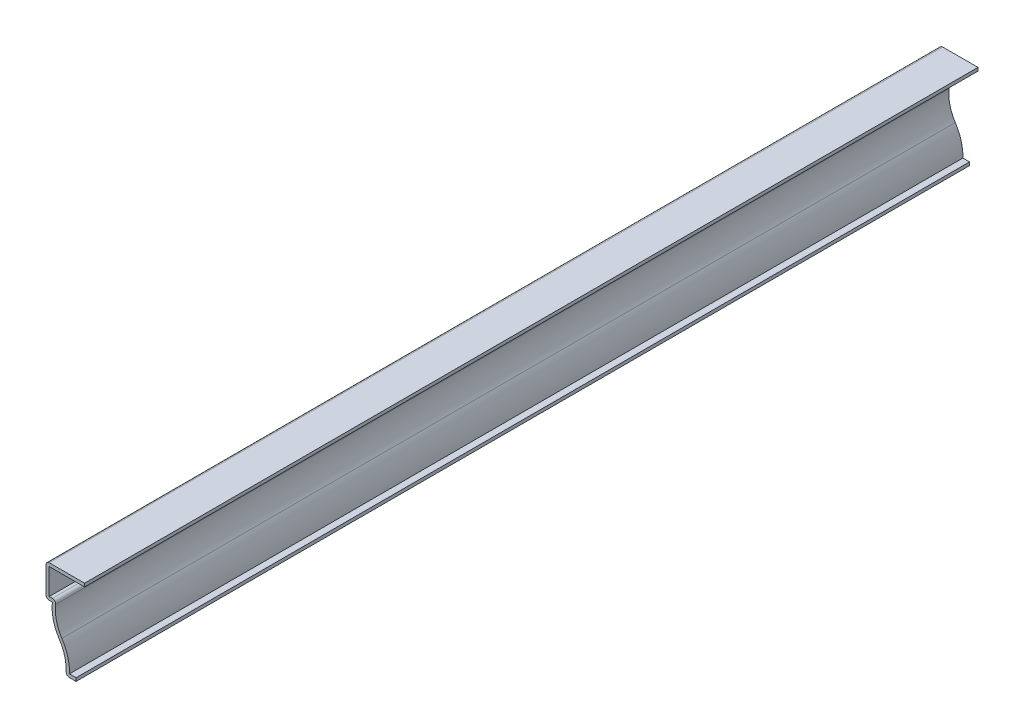
ISO-10303-21;
HEADER;
FILE_DESCRIPTION(('STEP AP214'),'2;1');
FILE_NAME('part.step','',(''),(''),'','','');
FILE_SCHEMA(('AUTOMOTIVE_DESIGN { 1 0 10303 214 1 1 1 1 }'));
ENDSEC;
DATA;
#1=APPLICATION_CONTEXT('core data for automotive mechanical design processes');
#2=APPLICATION_PROTOCOL_DEFINITION('international standard','automotive_design',2000,#1);
#3=PRODUCT_CONTEXT('',#1,'mechanical');
#4=PRODUCT('Part','Part','',(#3));
#5=PRODUCT_RELATED_PRODUCT_CATEGORY('part','',(#4));
#6=PRODUCT_DEFINITION_FORMATION('','',#4);
#7=PRODUCT_DEFINITION_CONTEXT('part definition',#1,'design');
#8=PRODUCT_DEFINITION('design','',#6,#7);
#9=PRODUCT_DEFINITION_SHAPE('','',#8);
#10=(LENGTH_UNIT() NAMED_UNIT(*) SI_UNIT(.MILLI.,.METRE.));
#11=(NAMED_UNIT(*) PLANE_ANGLE_UNIT() SI_UNIT($,.RADIAN.));
#12=(NAMED_UNIT(*) SI_UNIT($,.STERADIAN.) SOLID_ANGLE_UNIT());
#13=UNCERTAINTY_MEASURE_WITH_UNIT(LENGTH_MEASURE(1.E-05),#10,'distance_accuracy_value','');
#14=(GEOMETRIC_REPRESENTATION_CONTEXT(3) GLOBAL_UNCERTAINTY_ASSIGNED_CONTEXT((#13)) GLOBAL_UNIT_ASSIGNED_CONTEXT((#10,
#11,#12)) REPRESENTATION_CONTEXT('',''));
#15=CARTESIAN_POINT('',(0.,0.,0.));
#16=DIRECTION('',(0.,0.,1.));
#17=DIRECTION('',(1.,0.,0.));
#18=AXIS2_PLACEMENT_3D('',#15,#16,#17);
#19=CARTESIAN_POINT('',(-7.28179347826087,0.,-349.25));
#20=DIRECTION('',(0.,-1.,0.));
#21=DIRECTION('',(0.,0.,-1.));
#22=AXIS2_PLACEMENT_3D('',#19,#20,#21);
#23=PLANE('',#22);
#24=DIRECTION('',(1.,0.,0.));
#25=VECTOR('',#24,1.);
#26=CARTESIAN_POINT('',(-7.28179347826087,0.,0.));
#27=LINE('',#26,#25);
#28=CARTESIAN_POINT('',(-5.91270240569899,0.,0.));
#29=VERTEX_POINT('',#28);
#30=CARTESIAN_POINT('',(-3.31304347826087,0.,0.));
#31=VERTEX_POINT('',#30);
#32=EDGE_CURVE('E286',#29,#31,#27,.T.);
#33=ORIENTED_EDGE('',*,*,#32,.F.);
#34=DIRECTION('',(0.,0.,1.));
#35=VECTOR('',#34,1.);
#36=CARTESIAN_POINT('',(-5.91270240569899,0.,-349.25));
#37=LINE('',#36,#35);
#38=CARTESIAN_POINT('',(-5.91270240569899,0.,-349.25));
#39=VERTEX_POINT('',#38);
#40=EDGE_CURVE('E168',#29,#39,#37,.F.);
#41=ORIENTED_EDGE('',*,*,#40,.T.);
#42=DIRECTION('',(1.,0.,0.));
#43=VECTOR('',#42,1.);
#44=CARTESIAN_POINT('',(-7.28179347826087,0.,-349.25));
#45=LINE('',#44,#43);
#46=CARTESIAN_POINT('',(-3.31304347826087,0.,-349.25));
#47=VERTEX_POINT('',#46);
#48=EDGE_CURVE('E161',#39,#47,#45,.T.);
#49=ORIENTED_EDGE('',*,*,#48,.T.);
#50=DIRECTION('',(0.,0.,1.));
#51=VECTOR('',#50,1.);
#52=CARTESIAN_POINT('',(-3.31304347826087,0.,-349.25));
#53=LINE('',#52,#51);
#54=EDGE_CURVE('E165',#47,#31,#53,.T.);
#55=ORIENTED_EDGE('',*,*,#54,.T.);
#56=EDGE_LOOP('',(#33,#41,#49,#55));
#57=FACE_BOUND('',#56,.T.);
#58=ADVANCED_FACE('F35',(#57),#23,.T.);
#59=CARTESIAN_POINT('',(-23.839707036905,1.91904276840574,-349.25));
#60=DIRECTION('',(0.,0.,1.));
#61=DIRECTION('',(1.,0.,0.));
#62=AXIS2_PLACEMENT_3D('',#59,#60,#61);
#63=CYLINDRICAL_SURFACE('',#62,16.66875);
#64=CARTESIAN_POINT('',(-23.839707036905,1.91904276840574,-349.25));
#65=DIRECTION('',(0.,0.,-1.));
#66=DIRECTION('',(-1.,0.,0.));
#67=AXIS2_PLACEMENT_3D('',#64,#65,#66);
#68=CIRCLE('',#67,16.66875);
#69=CARTESIAN_POINT('',(-9.93547851845248,11.1125,-349.25));
#70=VERTEX_POINT('',#69);
#71=CARTESIAN_POINT('',(-7.1818708751649,1.3159499305066,-349.25));
#72=VERTEX_POINT('',#71);
#73=EDGE_CURVE('E185',#70,#72,#68,.T.);
#74=ORIENTED_EDGE('',*,*,#73,.T.);
#75=DIRECTION('',(0.,0.,1.));
#76=VECTOR('',#75,1.);
#77=CARTESIAN_POINT('',(-7.18187087516489,1.3159499305066,-349.25));
#78=LINE('',#77,#76);
#79=CARTESIAN_POINT('',(-7.1818708751649,1.3159499305066,0.));
#80=VERTEX_POINT('',#79);
#81=EDGE_CURVE('E194',#72,#80,#78,.T.);
#82=ORIENTED_EDGE('',*,*,#81,.T.);
#83=CARTESIAN_POINT('',(-23.839707036905,1.91904276840574,0.));
#84=DIRECTION('',(0.,0.,-1.));
#85=DIRECTION('',(-1.,0.,0.));
#86=AXIS2_PLACEMENT_3D('',#83,#84,#85);
#87=CIRCLE('',#86,16.66875);
#88=CARTESIAN_POINT('',(-9.93547851845248,11.1125,0.));
#89=VERTEX_POINT('',#88);
#90=EDGE_CURVE('E171',#89,#80,#87,.T.);
#91=ORIENTED_EDGE('',*,*,#90,.F.);
#92=DIRECTION('',(0.,0.,1.));
#93=VECTOR('',#92,1.);
#94=CARTESIAN_POINT('',(-9.93547851845248,11.1125,-349.25));
#95=LINE('',#94,#93);
#96=EDGE_CURVE('E198',#70,#89,#95,.T.);
#97=ORIENTED_EDGE('',*,*,#96,.F.);
#98=EDGE_LOOP('',(#74,#82,#91,#97));
#99=FACE_BOUND('',#98,.T.);
#100=ADVANCED_FACE('F322',(#99),#63,.F.);
#101=CARTESIAN_POINT('',(3.96875,20.3059572315943,-349.25));
#102=DIRECTION('',(0.,0.,1.));
#103=DIRECTION('',(1.,0.,0.));
#104=AXIS2_PLACEMENT_3D('',#101,#102,#103);
#105=CYLINDRICAL_SURFACE('',#104,16.66875);
#106=CARTESIAN_POINT('',(3.96875,20.3059572315943,0.));
#107=DIRECTION('',(0.,0.,1.));
#108=DIRECTION('',(1.,0.,0.));
#109=AXIS2_PLACEMENT_3D('',#106,#107,#108);
#110=CIRCLE('',#109,16.66875);
#111=CARTESIAN_POINT('',(-12.5891635586441,22.225,0.));
#112=VERTEX_POINT('',#111);
#113=EDGE_CURVE('E260',#112,#89,#110,.T.);
#114=ORIENTED_EDGE('',*,*,#113,.F.);
#115=DIRECTION('',(0.,0.,1.));
#116=VECTOR('',#115,1.);
#117=CARTESIAN_POINT('',(-12.5891635586441,22.225,-349.25));
#118=LINE('',#117,#116);
#119=CARTESIAN_POINT('',(-12.5891635586441,22.225,-349.25));
#120=VERTEX_POINT('',#119);
#121=EDGE_CURVE('E265',#120,#112,#118,.T.);
#122=ORIENTED_EDGE('',*,*,#121,.F.);
#123=CARTESIAN_POINT('',(3.96875,20.3059572315943,-349.25));
#124=DIRECTION('',(0.,0.,1.));
#125=DIRECTION('',(1.,0.,0.));
#126=AXIS2_PLACEMENT_3D('',#123,#124,#125);
#127=CIRCLE('',#126,16.66875);
#128=EDGE_CURVE('E190',#120,#70,#127,.T.);
#129=ORIENTED_EDGE('',*,*,#128,.T.);
#130=ORIENTED_EDGE('',*,*,#96,.T.);
#131=EDGE_LOOP('',(#114,#122,#129,#130));
#132=FACE_BOUND('',#131,.T.);
#133=ADVANCED_FACE('F327',(#132),#105,.T.);
#134=CARTESIAN_POINT('',(-15.08125,22.225,-349.25));
#135=DIRECTION('',(0.,-1.,0.));
#136=DIRECTION('',(0.,0.,-1.));
#137=AXIS2_PLACEMENT_3D('',#134,#135,#136);
#138=PLANE('',#137);
#139=DIRECTION('',(1.,0.,0.));
#140=VECTOR('',#139,1.);
#141=CARTESIAN_POINT('',(-15.08125,22.225,0.));
#142=LINE('',#141,#140);
#143=CARTESIAN_POINT('',(-13.81125,22.225,0.));
#144=VERTEX_POINT('',#143);
#145=EDGE_CURVE('E258',#144,#112,#142,.T.);
#146=ORIENTED_EDGE('',*,*,#145,.F.);
#147=DIRECTION('',(0.,0.,1.));
#148=VECTOR('',#147,1.);
#149=CARTESIAN_POINT('',(-13.81125,22.225,-349.25));
#150=LINE('',#149,#148);
#151=CARTESIAN_POINT('',(-13.81125,22.225,-349.25));
#152=VERTEX_POINT('',#151);
#153=EDGE_CURVE('E219',#144,#152,#150,.F.);
#154=ORIENTED_EDGE('',*,*,#153,.T.);
#155=DIRECTION('',(1.,0.,0.));
#156=VECTOR('',#155,1.);
#157=CARTESIAN_POINT('',(-15.08125,22.225,-349.25));
#158=LINE('',#157,#156);
#159=EDGE_CURVE('E292',#152,#120,#158,.T.);
#160=ORIENTED_EDGE('',*,*,#159,.T.);
#161=ORIENTED_EDGE('',*,*,#121,.T.);
#162=EDGE_LOOP('',(#146,#154,#160,#161));
#163=FACE_BOUND('',#162,.T.);
#164=ADVANCED_FACE('F386',(#163),#138,.T.);
#165=CARTESIAN_POINT('',(-15.08125,34.925,-349.25));
#166=DIRECTION('',(-1.,0.,0.));
#167=DIRECTION('',(0.,-1.,0.));
#168=AXIS2_PLACEMENT_3D('',#165,#166,#167);
#169=PLANE('',#168);
#170=DIRECTION('',(0.,-1.,0.));
#171=VECTOR('',#170,1.);
#172=CARTESIAN_POINT('',(-15.08125,34.925,-349.25));
#173=LINE('',#172,#171);
#174=CARTESIAN_POINT('',(-15.08125,33.655,-349.25));
#175=VERTEX_POINT('',#174);
#176=CARTESIAN_POINT('',(-15.08125,23.495,-349.25));
#177=VERTEX_POINT('',#176);
#178=EDGE_CURVE('E294',#175,#177,#173,.T.);
#179=ORIENTED_EDGE('',*,*,#178,.T.);
#180=DIRECTION('',(0.,0.,1.));
#181=VECTOR('',#180,1.);
#182=CARTESIAN_POINT('',(-15.08125,23.495,-349.25));
#183=LINE('',#182,#181);
#184=CARTESIAN_POINT('',(-15.08125,23.495,0.));
#185=VERTEX_POINT('',#184);
#186=EDGE_CURVE('E216',#177,#185,#183,.T.);
#187=ORIENTED_EDGE('',*,*,#186,.T.);
#188=DIRECTION('',(0.,-1.,0.));
#189=VECTOR('',#188,1.);
#190=CARTESIAN_POINT('',(-15.08125,34.925,0.));
#191=LINE('',#190,#189);
#192=CARTESIAN_POINT('',(-15.08125,33.655,0.));
#193=VERTEX_POINT('',#192);
#194=EDGE_CURVE('E255',#193,#185,#191,.T.);
#195=ORIENTED_EDGE('',*,*,#194,.F.);
#196=DIRECTION('',(0.,0.,1.));
#197=VECTOR('',#196,1.);
#198=CARTESIAN_POINT('',(-15.08125,33.655,-349.25));
#199=LINE('',#198,#197);
#200=EDGE_CURVE('E214',#193,#175,#199,.F.);
#201=ORIENTED_EDGE('',*,*,#200,.T.);
#202=EDGE_LOOP('',(#179,#187,#195,#201));
#203=FACE_BOUND('',#202,.T.);
#204=ADVANCED_FACE('F383',(#203),#169,.T.);
#205=CARTESIAN_POINT('',(0.,34.925,-349.25));
#206=DIRECTION('',(0.,1.,0.));
#207=DIRECTION('',(0.,0.,1.));
#208=AXIS2_PLACEMENT_3D('',#205,#206,#207);
#209=PLANE('',#208);
#210=DIRECTION('',(-1.,0.,0.));
#211=VECTOR('',#210,1.);
#212=CARTESIAN_POINT('',(0.,34.925,-349.25));
#213=LINE('',#212,#211);
#214=CARTESIAN_POINT('',(0.,34.925,-349.25));
#215=VERTEX_POINT('',#214);
#216=CARTESIAN_POINT('',(-13.81125,34.925,-349.25));
#217=VERTEX_POINT('',#216);
#218=EDGE_CURVE('E297',#215,#217,#213,.T.);
#219=ORIENTED_EDGE('',*,*,#218,.T.);
#220=DIRECTION('',(0.,0.,1.));
#221=VECTOR('',#220,1.);
#222=CARTESIAN_POINT('',(-13.81125,34.925,-349.25));
#223=LINE('',#222,#221);
#224=CARTESIAN_POINT('',(-13.81125,34.925,0.));
#225=VERTEX_POINT('',#224);
#226=EDGE_CURVE('E11',#217,#225,#223,.T.);
#227=ORIENTED_EDGE('',*,*,#226,.T.);
#228=DIRECTION('',(-1.,0.,0.));
#229=VECTOR('',#228,1.);
#230=CARTESIAN_POINT('',(0.,34.925,0.));
#231=LINE('',#230,#229);
#232=CARTESIAN_POINT('',(0.,34.925,0.));
#233=VERTEX_POINT('',#232);
#234=EDGE_CURVE('E252',#233,#225,#231,.T.);
#235=ORIENTED_EDGE('',*,*,#234,.F.);
#236=DIRECTION('',(0.,0.,1.));
#237=VECTOR('',#236,1.);
#238=CARTESIAN_POINT('',(0.,34.925,-349.25));
#239=LINE('',#238,#237);
#240=EDGE_CURVE('E268',#215,#233,#239,.T.);
#241=ORIENTED_EDGE('',*,*,#240,.F.);
#242=EDGE_LOOP('',(#219,#227,#235,#241));
#243=FACE_BOUND('',#242,.T.);
#244=ADVANCED_FACE('F353',(#243),#209,.T.);
#245=CARTESIAN_POINT('',(0.,34.925,-349.25));
#246=DIRECTION('',(-1.,0.,0.));
#247=DIRECTION('',(0.,0.,1.));
#248=AXIS2_PLACEMENT_3D('',#245,#246,#247);
#249=PLANE('',#248);
#250=DIRECTION('',(0.,-1.,0.));
#251=VECTOR('',#250,1.);
#252=CARTESIAN_POINT('',(0.,34.925,0.));
#253=LINE('',#252,#251);
#254=CARTESIAN_POINT('',(0.,33.655,0.));
#255=VERTEX_POINT('',#254);
#256=EDGE_CURVE('E250',#233,#255,#253,.T.);
#257=ORIENTED_EDGE('',*,*,#256,.T.);
#258=DIRECTION('',(0.,0.,1.));
#259=VECTOR('',#258,1.);
#260=CARTESIAN_POINT('',(0.,33.655,-349.25));
#261=LINE('',#260,#259);
#262=CARTESIAN_POINT('',(0.,33.655,-349.25));
#263=VERTEX_POINT('',#262);
#264=EDGE_CURVE('E270',#263,#255,#261,.T.);
#265=ORIENTED_EDGE('',*,*,#264,.F.);
#266=DIRECTION('',(0.,-1.,0.));
#267=VECTOR('',#266,1.);
#268=CARTESIAN_POINT('',(0.,34.925,-349.25));
#269=LINE('',#268,#267);
#270=EDGE_CURVE('E300',#215,#263,#269,.T.);
#271=ORIENTED_EDGE('',*,*,#270,.F.);
#272=ORIENTED_EDGE('',*,*,#240,.T.);
#273=EDGE_LOOP('',(#257,#265,#271,#272));
#274=FACE_BOUND('',#273,.T.);
#275=ADVANCED_FACE('F359',(#274),#249,.F.);
#276=CARTESIAN_POINT('',(0.,33.655,-349.25));
#277=DIRECTION('',(0.,1.,0.));
#278=DIRECTION('',(0.,0.,1.));
#279=AXIS2_PLACEMENT_3D('',#276,#277,#278);
#280=PLANE('',#279);
#281=DIRECTION('',(1.,0.,0.));
#282=VECTOR('',#281,1.);
#283=CARTESIAN_POINT('',(0.,33.655,0.));
#284=LINE('',#283,#282);
#285=CARTESIAN_POINT('',(-13.81125,33.655,0.));
#286=VERTEX_POINT('',#285);
#287=EDGE_CURVE('E248',#255,#286,#284,.F.);
#288=ORIENTED_EDGE('',*,*,#287,.T.);
#289=DIRECTION('',(0.,0.,1.));
#290=VECTOR('',#289,1.);
#291=CARTESIAN_POINT('',(-13.81125,33.655,-349.25));
#292=LINE('',#291,#290);
#293=CARTESIAN_POINT('',(-13.81125,33.655,-349.25));
#294=VERTEX_POINT('',#293);
#295=EDGE_CURVE('E273',#294,#286,#292,.T.);
#296=ORIENTED_EDGE('',*,*,#295,.F.);
#297=DIRECTION('',(1.,0.,0.));
#298=VECTOR('',#297,1.);
#299=CARTESIAN_POINT('',(0.,33.655,-349.25));
#300=LINE('',#299,#298);
#301=EDGE_CURVE('E302',#263,#294,#300,.F.);
#302=ORIENTED_EDGE('',*,*,#301,.F.);
#303=ORIENTED_EDGE('',*,*,#264,.T.);
#304=EDGE_LOOP('',(#288,#296,#302,#303));
#305=FACE_BOUND('',#304,.T.);
#306=ADVANCED_FACE('F365',(#305),#280,.F.);
#307=CARTESIAN_POINT('',(-13.81125,34.925,-349.25));
#308=DIRECTION('',(-1.,0.,0.));
#309=DIRECTION('',(0.,-1.,0.));
#310=AXIS2_PLACEMENT_3D('',#307,#308,#309);
#311=PLANE('',#310);
#312=DIRECTION('',(0.,-1.,0.));
#313=VECTOR('',#312,1.);
#314=CARTESIAN_POINT('',(-13.81125,34.925,0.));
#315=LINE('',#314,#313);
#316=CARTESIAN_POINT('',(-13.81125,23.495,0.));
#317=VERTEX_POINT('',#316);
#318=EDGE_CURVE('E241',#286,#317,#315,.T.);
#319=ORIENTED_EDGE('',*,*,#318,.T.);
#320=DIRECTION('',(0.,0.,1.));
#321=VECTOR('',#320,1.);
#322=CARTESIAN_POINT('',(-13.81125,23.495,-349.25));
#323=LINE('',#322,#321);
#324=CARTESIAN_POINT('',(-13.81125,23.495,-349.25));
#325=VERTEX_POINT('',#324);
#326=EDGE_CURVE('E276',#325,#317,#323,.T.);
#327=ORIENTED_EDGE('',*,*,#326,.F.);
#328=DIRECTION('',(0.,-1.,0.));
#329=VECTOR('',#328,1.);
#330=CARTESIAN_POINT('',(-13.81125,34.925,-349.25));
#331=LINE('',#330,#329);
#332=EDGE_CURVE('E304',#294,#325,#331,.T.);
#333=ORIENTED_EDGE('',*,*,#332,.F.);
#334=ORIENTED_EDGE('',*,*,#295,.T.);
#335=EDGE_LOOP('',(#319,#327,#333,#334));
#336=FACE_BOUND('',#335,.T.);
#337=ADVANCED_FACE('F369',(#336),#311,.F.);
#338=CARTESIAN_POINT('',(-15.08125,23.495,-349.25));
#339=DIRECTION('',(0.,-1.,0.));
#340=DIRECTION('',(0.,0.,-1.));
#341=AXIS2_PLACEMENT_3D('',#338,#339,#340);
#342=PLANE('',#341);
#343=DIRECTION('',(1.,0.,0.));
#344=VECTOR('',#343,1.);
#345=CARTESIAN_POINT('',(-15.08125,23.495,0.));
#346=LINE('',#345,#344);
#347=CARTESIAN_POINT('',(-12.5891635586441,23.495,0.));
#348=VERTEX_POINT('',#347);
#349=EDGE_CURVE('E239',#317,#348,#346,.T.);
#350=ORIENTED_EDGE('',*,*,#349,.T.);
#351=DIRECTION('',(0.,0.,1.));
#352=VECTOR('',#351,1.);
#353=CARTESIAN_POINT('',(-12.5891635586441,23.495,-349.25));
#354=LINE('',#353,#352);
#355=CARTESIAN_POINT('',(-12.5891635586441,23.495,-349.25));
#356=VERTEX_POINT('',#355);
#357=EDGE_CURVE('E43',#348,#356,#354,.F.);
#358=ORIENTED_EDGE('',*,*,#357,.T.);
#359=DIRECTION('',(1.,0.,0.));
#360=VECTOR('',#359,1.);
#361=CARTESIAN_POINT('',(-15.08125,23.495,-349.25));
#362=LINE('',#361,#360);
#363=EDGE_CURVE('E306',#325,#356,#362,.T.);
#364=ORIENTED_EDGE('',*,*,#363,.F.);
#365=ORIENTED_EDGE('',*,*,#326,.T.);
#366=EDGE_LOOP('',(#350,#358,#364,#365));
#367=FACE_BOUND('',#366,.T.);
#368=ADVANCED_FACE('F319',(#367),#342,.F.);
#369=CARTESIAN_POINT('',(3.96875,20.3059572315943,-349.25));
#370=DIRECTION('',(0.,0.,1.));
#371=DIRECTION('',(1.,0.,0.));
#372=AXIS2_PLACEMENT_3D('',#369,#370,#371);
#373=CYLINDRICAL_SURFACE('',#372,15.39875);
#374=CARTESIAN_POINT('',(3.96875,20.3059572315943,-349.25));
#375=DIRECTION('',(0.,0.,1.));
#376=DIRECTION('',(1.,0.,0.));
#377=AXIS2_PLACEMENT_3D('',#374,#375,#376);
#378=CIRCLE('',#377,15.39875);
#379=CARTESIAN_POINT('',(-11.3276082398902,22.0787872176453,-349.25));
#380=VERTEX_POINT('',#379);
#381=CARTESIAN_POINT('',(-8.87610872657038,11.8129538843119,-349.25));
#382=VERTEX_POINT('',#381);
#383=EDGE_CURVE('E230',#380,#382,#378,.T.);
#384=ORIENTED_EDGE('',*,*,#383,.F.);
#385=DIRECTION('',(0.,0.,1.));
#386=VECTOR('',#385,1.);
#387=CARTESIAN_POINT('',(-11.3276082398902,22.0787872176453,-349.25));
#388=LINE('',#387,#386);
#389=CARTESIAN_POINT('',(-11.3276082398902,22.0787872176453,0.));
#390=VERTEX_POINT('',#389);
#391=EDGE_CURVE('E221',#380,#390,#388,.T.);
#392=ORIENTED_EDGE('',*,*,#391,.T.);
#393=CARTESIAN_POINT('',(3.96875,20.3059572315943,0.));
#394=DIRECTION('',(0.,0.,1.));
#395=DIRECTION('',(1.,0.,0.));
#396=AXIS2_PLACEMENT_3D('',#393,#394,#395);
#397=CIRCLE('',#396,15.39875);
#398=CARTESIAN_POINT('',(-8.87610872657038,11.8129538843119,0.));
#399=VERTEX_POINT('',#398);
#400=EDGE_CURVE('E228',#390,#399,#397,.T.);
#401=ORIENTED_EDGE('',*,*,#400,.T.);
#402=DIRECTION('',(0.,0.,1.));
#403=VECTOR('',#402,1.);
#404=CARTESIAN_POINT('',(-8.87610872657038,11.8129538843119,-349.25));
#405=LINE('',#404,#403);
#406=EDGE_CURVE('E279',#382,#399,#405,.T.);
#407=ORIENTED_EDGE('',*,*,#406,.F.);
#408=EDGE_LOOP('',(#384,#392,#401,#407));
#409=FACE_BOUND('',#408,.T.);
#410=ADVANCED_FACE('F226',(#409),#373,.F.);
#411=CARTESIAN_POINT('',(-23.839707036905,1.91904276840574,-349.25));
#412=DIRECTION('',(0.,0.,1.));
#413=DIRECTION('',(1.,0.,0.));
#414=AXIS2_PLACEMENT_3D('',#411,#412,#413);
#415=CYLINDRICAL_SURFACE('',#414,17.93875);
#416=CARTESIAN_POINT('',(-23.839707036905,1.91904276840574,0.));
#417=DIRECTION('',(0.,0.,1.));
#418=DIRECTION('',(1.,0.,0.));
#419=AXIS2_PLACEMENT_3D('',#416,#417,#418);
#420=CIRCLE('',#419,17.93875);
#421=CARTESIAN_POINT('',(-5.91270240569899,1.27,0.));
#422=VERTEX_POINT('',#421);
#423=EDGE_CURVE('E238',#399,#422,#420,.F.);
#424=ORIENTED_EDGE('',*,*,#423,.T.);
#425=DIRECTION('',(0.,0.,1.));
#426=VECTOR('',#425,1.);
#427=CARTESIAN_POINT('',(-5.91270240569899,1.27,-349.25));
#428=LINE('',#427,#426);
#429=CARTESIAN_POINT('',(-5.91270240569899,1.27,-349.25));
#430=VERTEX_POINT('',#429);
#431=EDGE_CURVE('E187',#430,#422,#428,.T.);
#432=ORIENTED_EDGE('',*,*,#431,.F.);
#433=CARTESIAN_POINT('',(-23.839707036905,1.91904276840574,-349.25));
#434=DIRECTION('',(0.,0.,1.));
#435=DIRECTION('',(1.,0.,0.));
#436=AXIS2_PLACEMENT_3D('',#433,#434,#435);
#437=CIRCLE('',#436,17.93875);
#438=EDGE_CURVE('E309',#382,#430,#437,.F.);
#439=ORIENTED_EDGE('',*,*,#438,.F.);
#440=ORIENTED_EDGE('',*,*,#406,.T.);
#441=EDGE_LOOP('',(#424,#432,#439,#440));
#442=FACE_BOUND('',#441,.T.);
#443=ADVANCED_FACE('F311',(#442),#415,.T.);
#444=CARTESIAN_POINT('',(-7.28179347826087,1.27,-349.25));
#445=DIRECTION('',(0.,-1.,0.));
#446=DIRECTION('',(0.,0.,-1.));
#447=AXIS2_PLACEMENT_3D('',#444,#445,#446);
#448=PLANE('',#447);
#449=DIRECTION('',(1.,0.,0.));
#450=VECTOR('',#449,1.);
#451=CARTESIAN_POINT('',(-7.28179347826087,1.27,0.));
#452=LINE('',#451,#450);
#453=CARTESIAN_POINT('',(-3.31304347826087,1.27,0.));
#454=VERTEX_POINT('',#453);
#455=EDGE_CURVE('E243',#422,#454,#452,.T.);
#456=ORIENTED_EDGE('',*,*,#455,.T.);
#457=DIRECTION('',(0.,0.,1.));
#458=VECTOR('',#457,1.);
#459=CARTESIAN_POINT('',(-3.31304347826087,1.27,-349.25));
#460=LINE('',#459,#458);
#461=CARTESIAN_POINT('',(-3.31304347826087,1.27,-349.25));
#462=VERTEX_POINT('',#461);
#463=EDGE_CURVE('E184',#462,#454,#460,.T.);
#464=ORIENTED_EDGE('',*,*,#463,.F.);
#465=DIRECTION('',(1.,0.,0.));
#466=VECTOR('',#465,1.);
#467=CARTESIAN_POINT('',(-7.28179347826087,1.27,-349.25));
#468=LINE('',#467,#466);
#469=EDGE_CURVE('E176',#430,#462,#468,.T.);
#470=ORIENTED_EDGE('',*,*,#469,.F.);
#471=ORIENTED_EDGE('',*,*,#431,.T.);
#472=EDGE_LOOP('',(#456,#464,#470,#471));
#473=FACE_BOUND('',#472,.T.);
#474=ADVANCED_FACE('F283',(#473),#448,.F.);
#475=CARTESIAN_POINT('',(-3.31304347826087,1.27,-349.25));
#476=DIRECTION('',(-1.,0.,0.));
#477=DIRECTION('',(0.,0.,1.));
#478=AXIS2_PLACEMENT_3D('',#475,#476,#477);
#479=PLANE('',#478);
#480=DIRECTION('',(0.,-1.,0.));
#481=VECTOR('',#480,1.);
#482=CARTESIAN_POINT('',(-3.31304347826087,1.27,0.));
#483=LINE('',#482,#481);
#484=EDGE_CURVE('E183',#454,#31,#483,.T.);
#485=ORIENTED_EDGE('',*,*,#484,.T.);
#486=ORIENTED_EDGE('',*,*,#54,.F.);
#487=DIRECTION('',(0.,-1.,0.));
#488=VECTOR('',#487,1.);
#489=CARTESIAN_POINT('',(-3.31304347826087,1.27,-349.25));
#490=LINE('',#489,#488);
#491=EDGE_CURVE('E170',#462,#47,#490,.T.);
#492=ORIENTED_EDGE('',*,*,#491,.F.);
#493=ORIENTED_EDGE('',*,*,#463,.T.);
#494=EDGE_LOOP('',(#485,#486,#492,#493));
#495=FACE_BOUND('',#494,.T.);
#496=ADVANCED_FACE('F181',(#495),#479,.F.);
#497=CARTESIAN_POINT('',(-23.839707036905,1.91904276840574,-349.25));
#498=DIRECTION('',(0.,0.,1.));
#499=DIRECTION('',(1.,0.,0.));
#500=AXIS2_PLACEMENT_3D('',#497,#498,#499);
#501=PLANE('',#500);
#502=ORIENTED_EDGE('',*,*,#48,.F.);
#503=CARTESIAN_POINT('',(-5.91270240569899,1.27,-349.25));
#504=DIRECTION('',(0.,0.,1.));
#505=DIRECTION('',(1.,0.,0.));
#506=AXIS2_PLACEMENT_3D('',#503,#504,#505);
#507=CIRCLE('',#506,1.27);
#508=EDGE_CURVE('E212',#39,#72,#507,.F.);
#509=ORIENTED_EDGE('',*,*,#508,.T.);
#510=ORIENTED_EDGE('',*,*,#73,.F.);
#511=ORIENTED_EDGE('',*,*,#128,.F.);
#512=ORIENTED_EDGE('',*,*,#159,.F.);
#513=CARTESIAN_POINT('',(-13.81125,23.495,-349.25));
#514=DIRECTION('',(0.,0.,1.));
#515=DIRECTION('',(1.,0.,0.));
#516=AXIS2_PLACEMENT_3D('',#513,#514,#515);
#517=CIRCLE('',#516,1.27);
#518=EDGE_CURVE('E210',#152,#177,#517,.F.);
#519=ORIENTED_EDGE('',*,*,#518,.T.);
#520=ORIENTED_EDGE('',*,*,#178,.F.);
#521=CARTESIAN_POINT('',(-13.81125,33.655,-349.25));
#522=DIRECTION('',(0.,0.,1.));
#523=DIRECTION('',(1.,0.,0.));
#524=AXIS2_PLACEMENT_3D('',#521,#522,#523);
#525=CIRCLE('',#524,1.27);
#526=EDGE_CURVE('E207',#175,#217,#525,.F.);
#527=ORIENTED_EDGE('',*,*,#526,.T.);
#528=ORIENTED_EDGE('',*,*,#218,.F.);
#529=ORIENTED_EDGE('',*,*,#270,.T.);
#530=ORIENTED_EDGE('',*,*,#301,.T.);
#531=ORIENTED_EDGE('',*,*,#332,.T.);
#532=ORIENTED_EDGE('',*,*,#363,.T.);
#533=CARTESIAN_POINT('',(-12.5891635586441,22.225,-349.25));
#534=DIRECTION('',(0.,0.,1.));
#535=DIRECTION('',(1.,0.,0.));
#536=AXIS2_PLACEMENT_3D('',#533,#534,#535);
#537=CIRCLE('',#536,1.27);
#538=EDGE_CURVE('E50',#356,#380,#537,.F.);
#539=ORIENTED_EDGE('',*,*,#538,.T.);
#540=ORIENTED_EDGE('',*,*,#383,.T.);
#541=ORIENTED_EDGE('',*,*,#438,.T.);
#542=ORIENTED_EDGE('',*,*,#469,.T.);
#543=ORIENTED_EDGE('',*,*,#491,.T.);
#544=EDGE_LOOP('',(#502,#509,#510,#511,#512,#519,#520,#527,#528,#529,#530,#531,#532,#539,#540,
#541,#542,#543));
#545=FACE_BOUND('',#544,.T.);
#546=ADVANCED_FACE('F174',(#545),#501,.F.);
#547=CARTESIAN_POINT('',(-23.839707036905,1.91904276840574,0.));
#548=DIRECTION('',(0.,0.,1.));
#549=DIRECTION('',(1.,0.,0.));
#550=AXIS2_PLACEMENT_3D('',#547,#548,#549);
#551=PLANE('',#550);
#552=ORIENTED_EDGE('',*,*,#90,.T.);
#553=CARTESIAN_POINT('',(-5.91270240569899,1.27,0.));
#554=DIRECTION('',(0.,0.,1.));
#555=DIRECTION('',(1.,0.,0.));
#556=AXIS2_PLACEMENT_3D('',#553,#554,#555);
#557=CIRCLE('',#556,1.27);
#558=EDGE_CURVE('E204',#80,#29,#557,.T.);
#559=ORIENTED_EDGE('',*,*,#558,.T.);
#560=ORIENTED_EDGE('',*,*,#32,.T.);
#561=ORIENTED_EDGE('',*,*,#484,.F.);
#562=ORIENTED_EDGE('',*,*,#455,.F.);
#563=ORIENTED_EDGE('',*,*,#423,.F.);
#564=ORIENTED_EDGE('',*,*,#400,.F.);
#565=CARTESIAN_POINT('',(-12.5891635586441,22.225,0.));
#566=DIRECTION('',(0.,0.,1.));
#567=DIRECTION('',(1.,0.,0.));
#568=AXIS2_PLACEMENT_3D('',#565,#566,#567);
#569=CIRCLE('',#568,1.27);
#570=EDGE_CURVE('E200',#390,#348,#569,.T.);
#571=ORIENTED_EDGE('',*,*,#570,.T.);
#572=ORIENTED_EDGE('',*,*,#349,.F.);
#573=ORIENTED_EDGE('',*,*,#318,.F.);
#574=ORIENTED_EDGE('',*,*,#287,.F.);
#575=ORIENTED_EDGE('',*,*,#256,.F.);
#576=ORIENTED_EDGE('',*,*,#234,.T.);
#577=CARTESIAN_POINT('',(-13.81125,33.655,0.));
#578=DIRECTION('',(0.,0.,1.));
#579=DIRECTION('',(1.,0.,0.));
#580=AXIS2_PLACEMENT_3D('',#577,#578,#579);
#581=CIRCLE('',#580,1.27);
#582=EDGE_CURVE('E197',#225,#193,#581,.T.);
#583=ORIENTED_EDGE('',*,*,#582,.T.);
#584=ORIENTED_EDGE('',*,*,#194,.T.);
#585=CARTESIAN_POINT('',(-13.81125,23.495,0.));
#586=DIRECTION('',(0.,0.,1.));
#587=DIRECTION('',(1.,0.,0.));
#588=AXIS2_PLACEMENT_3D('',#585,#586,#587);
#589=CIRCLE('',#588,1.27);
#590=EDGE_CURVE('E202',#185,#144,#589,.T.);
#591=ORIENTED_EDGE('',*,*,#590,.T.);
#592=ORIENTED_EDGE('',*,*,#145,.T.);
#593=ORIENTED_EDGE('',*,*,#113,.T.);
#594=EDGE_LOOP('',(#552,#559,#560,#561,#562,#563,#564,#571,#572,#573,#574,#575,#576,#583,#584,
#591,#592,#593));
#595=FACE_BOUND('',#594,.T.);
#596=ADVANCED_FACE('F235',(#595),#551,.T.);
#597=CARTESIAN_POINT('',(-5.91270240569899,1.27,-349.25));
#598=DIRECTION('',(0.,0.,1.));
#599=DIRECTION('',(1.,0.,0.));
#600=AXIS2_PLACEMENT_3D('',#597,#598,#599);
#601=CYLINDRICAL_SURFACE('',#600,1.27);
#602=ORIENTED_EDGE('',*,*,#508,.F.);
#603=ORIENTED_EDGE('',*,*,#40,.F.);
#604=ORIENTED_EDGE('',*,*,#558,.F.);
#605=ORIENTED_EDGE('',*,*,#81,.F.);
#606=EDGE_LOOP('',(#602,#603,#604,#605));
#607=FACE_BOUND('',#606,.T.);
#608=ADVANCED_FACE('F332',(#607),#601,.T.);
#609=CARTESIAN_POINT('',(-13.81125,23.495,-349.25));
#610=DIRECTION('',(0.,0.,1.));
#611=DIRECTION('',(1.,0.,0.));
#612=AXIS2_PLACEMENT_3D('',#609,#610,#611);
#613=CYLINDRICAL_SURFACE('',#612,1.27);
#614=ORIENTED_EDGE('',*,*,#518,.F.);
#615=ORIENTED_EDGE('',*,*,#153,.F.);
#616=ORIENTED_EDGE('',*,*,#590,.F.);
#617=ORIENTED_EDGE('',*,*,#186,.F.);
#618=EDGE_LOOP('',(#614,#615,#616,#617));
#619=FACE_BOUND('',#618,.T.);
#620=ADVANCED_FACE('F335',(#619),#613,.T.);
#621=CARTESIAN_POINT('',(-12.5891635586441,22.225,-349.25));
#622=DIRECTION('',(0.,0.,1.));
#623=DIRECTION('',(1.,0.,0.));
#624=AXIS2_PLACEMENT_3D('',#621,#622,#623);
#625=CYLINDRICAL_SURFACE('',#624,1.27);
#626=ORIENTED_EDGE('',*,*,#538,.F.);
#627=ORIENTED_EDGE('',*,*,#357,.F.);
#628=ORIENTED_EDGE('',*,*,#570,.F.);
#629=ORIENTED_EDGE('',*,*,#391,.F.);
#630=EDGE_LOOP('',(#626,#627,#628,#629));
#631=FACE_BOUND('',#630,.T.);
#632=ADVANCED_FACE('F338',(#631),#625,.T.);
#633=CARTESIAN_POINT('',(-13.81125,33.655,-349.25));
#634=DIRECTION('',(0.,0.,1.));
#635=DIRECTION('',(1.,0.,0.));
#636=AXIS2_PLACEMENT_3D('',#633,#634,#635);
#637=CYLINDRICAL_SURFACE('',#636,1.27);
#638=ORIENTED_EDGE('',*,*,#526,.F.);
#639=ORIENTED_EDGE('',*,*,#200,.F.);
#640=ORIENTED_EDGE('',*,*,#582,.F.);
#641=ORIENTED_EDGE('',*,*,#226,.F.);
#642=EDGE_LOOP('',(#638,#639,#640,#641));
#643=FACE_BOUND('',#642,.T.);
#644=ADVANCED_FACE('F37',(#643),#637,.T.);
#645=CLOSED_SHELL('',(#58,#100,#133,#164,#204,#244,#275,#306,#337,#368,#410,#443,#474,#496,#546,
#596,#608,#620,#632,#644));
#646=MANIFOLD_SOLID_BREP('B2',#645);
#647=ADVANCED_BREP_SHAPE_REPRESENTATION('',(#18,#646),#14);
#648=SHAPE_DEFINITION_REPRESENTATION(#9,#647);
ENDSEC;
END-ISO-10303-21;
